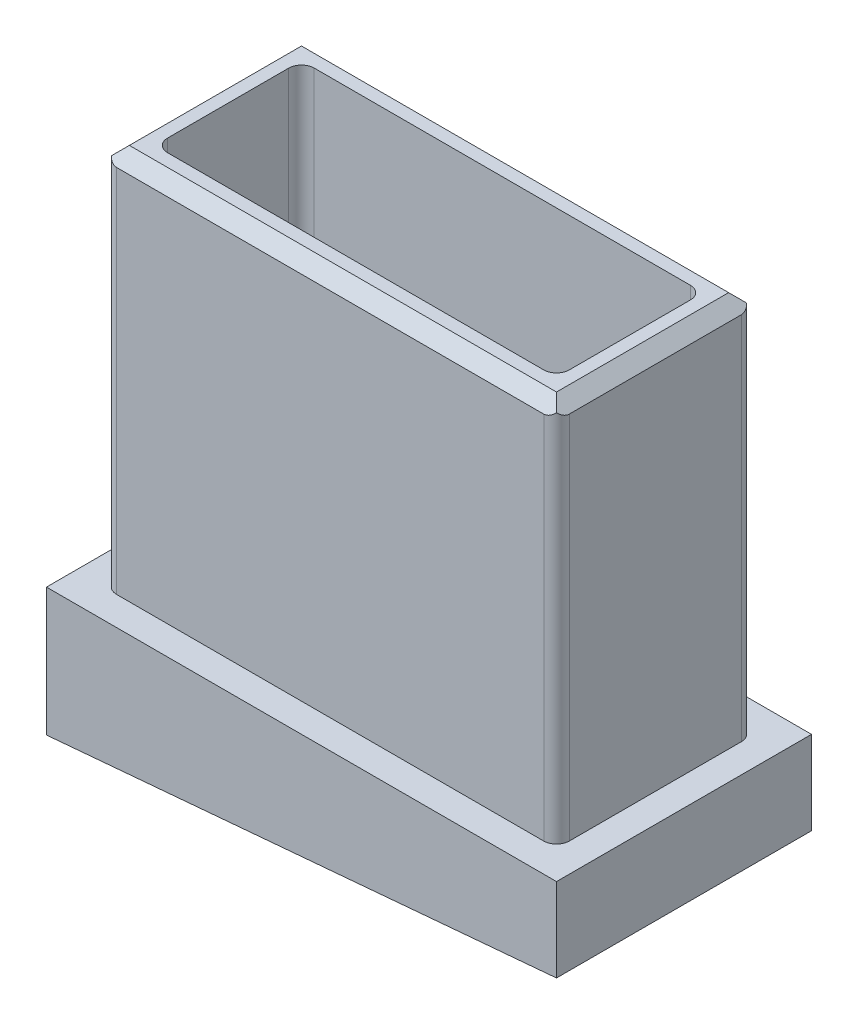
ISO-10303-21;
HEADER;
FILE_DESCRIPTION(('STEP AP214'),'2;1');
FILE_NAME('part.step','',(''),(''),'','','');
FILE_SCHEMA(('AUTOMOTIVE_DESIGN { 1 0 10303 214 1 1 1 1 }'));
ENDSEC;
DATA;
#1=APPLICATION_CONTEXT('core data for automotive mechanical design processes');
#2=APPLICATION_PROTOCOL_DEFINITION('international standard','automotive_design',2000,#1);
#3=PRODUCT_CONTEXT('',#1,'mechanical');
#4=PRODUCT('Part','Part','',(#3));
#5=PRODUCT_RELATED_PRODUCT_CATEGORY('part','',(#4));
#6=PRODUCT_DEFINITION_FORMATION('','',#4);
#7=PRODUCT_DEFINITION_CONTEXT('part definition',#1,'design');
#8=PRODUCT_DEFINITION('design','',#6,#7);
#9=PRODUCT_DEFINITION_SHAPE('','',#8);
#10=(LENGTH_UNIT() NAMED_UNIT(*) SI_UNIT(.MILLI.,.METRE.));
#11=(NAMED_UNIT(*) PLANE_ANGLE_UNIT() SI_UNIT($,.RADIAN.));
#12=(NAMED_UNIT(*) SI_UNIT($,.STERADIAN.) SOLID_ANGLE_UNIT());
#13=UNCERTAINTY_MEASURE_WITH_UNIT(LENGTH_MEASURE(1.E-05),#10,'distance_accuracy_value','');
#14=(GEOMETRIC_REPRESENTATION_CONTEXT(3) GLOBAL_UNCERTAINTY_ASSIGNED_CONTEXT((#13)) GLOBAL_UNIT_ASSIGNED_CONTEXT((#10,
#11,#12)) REPRESENTATION_CONTEXT('',''));
#15=CARTESIAN_POINT('',(0.,0.,0.));
#16=DIRECTION('',(0.,0.,1.));
#17=DIRECTION('',(1.,0.,0.));
#18=AXIS2_PLACEMENT_3D('',#15,#16,#17);
#19=CARTESIAN_POINT('',(22.5425,19.05,9.8425));
#20=DIRECTION('',(-1.,0.,0.));
#21=DIRECTION('',(0.,-1.,0.));
#22=AXIS2_PLACEMENT_3D('',#19,#20,#21);
#23=PLANE('',#22);
#24=DIRECTION('',(0.,0.,1.));
#25=VECTOR('',#24,1.);
#26=CARTESIAN_POINT('',(22.5425,17.78,9.8425));
#27=LINE('',#26,#25);
#28=CARTESIAN_POINT('',(22.5425,17.78,-8.5725));
#29=VERTEX_POINT('',#28);
#30=CARTESIAN_POINT('',(22.5425,17.78,8.5725));
#31=VERTEX_POINT('',#30);
#32=EDGE_CURVE('E256',#29,#31,#27,.T.);
#33=ORIENTED_EDGE('',*,*,#32,.T.);
#34=DIRECTION('',(0.,1.,0.));
#35=VECTOR('',#34,1.);
#36=CARTESIAN_POINT('',(22.5425,-19.05,8.5725));
#37=LINE('',#36,#35);
#38=CARTESIAN_POINT('',(22.5425,-19.05,8.5725));
#39=VERTEX_POINT('',#38);
#40=EDGE_CURVE('E290',#31,#39,#37,.F.);
#41=ORIENTED_EDGE('',*,*,#40,.T.);
#42=DIRECTION('',(0.,0.,-1.));
#43=VECTOR('',#42,1.);
#44=CARTESIAN_POINT('',(22.5425,-19.05,9.8425));
#45=LINE('',#44,#43);
#46=CARTESIAN_POINT('',(22.5425,-19.05,-8.5725));
#47=VERTEX_POINT('',#46);
#48=EDGE_CURVE('E233',#39,#47,#45,.T.);
#49=ORIENTED_EDGE('',*,*,#48,.T.);
#50=DIRECTION('',(0.,1.,0.));
#51=VECTOR('',#50,1.);
#52=CARTESIAN_POINT('',(22.5425,19.05,-8.5725));
#53=LINE('',#52,#51);
#54=EDGE_CURVE('E287',#47,#29,#53,.T.);
#55=ORIENTED_EDGE('',*,*,#54,.T.);
#56=EDGE_LOOP('',(#33,#41,#49,#55));
#57=FACE_BOUND('',#56,.T.);
#58=ADVANCED_FACE('F33',(#57),#23,.F.);
#59=CARTESIAN_POINT('',(-22.5425,19.05,9.8425));
#60=DIRECTION('',(0.,-1.,0.));
#61=DIRECTION('',(0.,0.,-1.));
#62=AXIS2_PLACEMENT_3D('',#59,#60,#61);
#63=PLANE('',#62);
#64=DIRECTION('',(-1.,0.,0.));
#65=VECTOR('',#64,1.);
#66=CARTESIAN_POINT('',(-22.5425,19.05,-8.57249999999999));
#67=LINE('',#66,#65);
#68=CARTESIAN_POINT('',(21.2725,19.05,-8.57249999999999));
#69=VERTEX_POINT('',#68);
#70=CARTESIAN_POINT('',(-21.2725,19.05,-8.57249999999999));
#71=VERTEX_POINT('',#70);
#72=EDGE_CURVE('E248',#69,#71,#67,.T.);
#73=ORIENTED_EDGE('',*,*,#72,.T.);
#74=DIRECTION('',(0.,0.,1.));
#75=VECTOR('',#74,1.);
#76=CARTESIAN_POINT('',(-21.2725,19.05,9.8425));
#77=LINE('',#76,#75);
#78=CARTESIAN_POINT('',(-21.2725,19.05,8.57249999999999));
#79=VERTEX_POINT('',#78);
#80=EDGE_CURVE('E250',#71,#79,#77,.T.);
#81=ORIENTED_EDGE('',*,*,#80,.T.);
#82=DIRECTION('',(1.,0.,0.));
#83=VECTOR('',#82,1.);
#84=CARTESIAN_POINT('',(22.5425,19.05,8.57249999999999));
#85=LINE('',#84,#83);
#86=CARTESIAN_POINT('',(21.2725,19.05,8.57249999999999));
#87=VERTEX_POINT('',#86);
#88=EDGE_CURVE('E243',#79,#87,#85,.T.);
#89=ORIENTED_EDGE('',*,*,#88,.T.);
#90=DIRECTION('',(0.,0.,-1.));
#91=VECTOR('',#90,1.);
#92=CARTESIAN_POINT('',(21.2725,19.05,9.8425));
#93=LINE('',#92,#91);
#94=EDGE_CURVE('E246',#87,#69,#93,.T.);
#95=ORIENTED_EDGE('',*,*,#94,.T.);
#96=EDGE_LOOP('',(#73,#81,#89,#95));
#97=FACE_BOUND('',#96,.T.);
#98=DIRECTION('',(-1.,0.,0.));
#99=VECTOR('',#98,1.);
#100=CARTESIAN_POINT('',(-20.0025,19.05,-7.3025));
#101=LINE('',#100,#99);
#102=CARTESIAN_POINT('',(18.7325,19.05,-7.3025));
#103=VERTEX_POINT('',#102);
#104=CARTESIAN_POINT('',(-18.7325,19.05,-7.3025));
#105=VERTEX_POINT('',#104);
#106=EDGE_CURVE('E656',#103,#105,#101,.T.);
#107=ORIENTED_EDGE('',*,*,#106,.F.);
#108=CARTESIAN_POINT('',(18.7325,19.05,-6.0325));
#109=DIRECTION('',(0.,-1.,0.));
#110=DIRECTION('',(0.,0.,-1.));
#111=AXIS2_PLACEMENT_3D('',#108,#109,#110);
#112=CIRCLE('',#111,1.27);
#113=CARTESIAN_POINT('',(20.0025,19.05,-6.0325));
#114=VERTEX_POINT('',#113);
#115=EDGE_CURVE('E342',#103,#114,#112,.T.);
#116=ORIENTED_EDGE('',*,*,#115,.T.);
#117=DIRECTION('',(0.,0.,-1.));
#118=VECTOR('',#117,1.);
#119=CARTESIAN_POINT('',(20.0025,19.05,-7.3025));
#120=LINE('',#119,#118);
#121=CARTESIAN_POINT('',(20.0025,19.05,6.0325));
#122=VERTEX_POINT('',#121);
#123=EDGE_CURVE('E273',#122,#114,#120,.T.);
#124=ORIENTED_EDGE('',*,*,#123,.F.);
#125=CARTESIAN_POINT('',(18.7325,19.05,6.0325));
#126=DIRECTION('',(0.,-1.,0.));
#127=DIRECTION('',(0.,0.,-1.));
#128=AXIS2_PLACEMENT_3D('',#125,#126,#127);
#129=CIRCLE('',#128,1.27);
#130=CARTESIAN_POINT('',(18.7325,19.05,7.3025));
#131=VERTEX_POINT('',#130);
#132=EDGE_CURVE('E340',#122,#131,#129,.T.);
#133=ORIENTED_EDGE('',*,*,#132,.T.);
#134=DIRECTION('',(1.,0.,0.));
#135=VECTOR('',#134,1.);
#136=CARTESIAN_POINT('',(-20.0025,19.05,7.3025));
#137=LINE('',#136,#135);
#138=CARTESIAN_POINT('',(-18.7325,19.05,7.3025));
#139=VERTEX_POINT('',#138);
#140=EDGE_CURVE('E649',#139,#131,#137,.T.);
#141=ORIENTED_EDGE('',*,*,#140,.F.);
#142=CARTESIAN_POINT('',(-18.7325,19.05,6.0325));
#143=DIRECTION('',(0.,-1.,0.));
#144=DIRECTION('',(0.,0.,-1.));
#145=AXIS2_PLACEMENT_3D('',#142,#143,#144);
#146=CIRCLE('',#145,1.27);
#147=CARTESIAN_POINT('',(-20.0025,19.05,6.0325));
#148=VERTEX_POINT('',#147);
#149=EDGE_CURVE('E344',#139,#148,#146,.T.);
#150=ORIENTED_EDGE('',*,*,#149,.T.);
#151=DIRECTION('',(0.,0.,1.));
#152=VECTOR('',#151,1.);
#153=CARTESIAN_POINT('',(-20.0025,19.05,-7.3025));
#154=LINE('',#153,#152);
#155=CARTESIAN_POINT('',(-20.0025,19.05,-6.0325));
#156=VERTEX_POINT('',#155);
#157=EDGE_CURVE('E653',#156,#148,#154,.T.);
#158=ORIENTED_EDGE('',*,*,#157,.F.);
#159=CARTESIAN_POINT('',(-18.7325,19.05,-6.0325));
#160=DIRECTION('',(0.,-1.,0.));
#161=DIRECTION('',(0.,0.,-1.));
#162=AXIS2_PLACEMENT_3D('',#159,#160,#161);
#163=CIRCLE('',#162,1.27);
#164=EDGE_CURVE('E346',#156,#105,#163,.T.);
#165=ORIENTED_EDGE('',*,*,#164,.T.);
#166=EDGE_LOOP('',(#107,#116,#124,#133,#141,#150,#158,#165));
#167=FACE_BOUND('',#166,.T.);
#168=ADVANCED_FACE('F369',(#97,#167),#63,.F.);
#169=CARTESIAN_POINT('',(-22.5425,19.05,9.8425));
#170=DIRECTION('',(1.,0.,0.));
#171=DIRECTION('',(0.,1.,0.));
#172=AXIS2_PLACEMENT_3D('',#169,#170,#171);
#173=PLANE('',#172);
#174=DIRECTION('',(0.,0.,-1.));
#175=VECTOR('',#174,1.);
#176=CARTESIAN_POINT('',(-22.5425,17.78,9.8425));
#177=LINE('',#176,#175);
#178=CARTESIAN_POINT('',(-22.5425,17.78,8.5725));
#179=VERTEX_POINT('',#178);
#180=CARTESIAN_POINT('',(-22.5425,17.78,-8.5725));
#181=VERTEX_POINT('',#180);
#182=EDGE_CURVE('E240',#179,#181,#177,.T.);
#183=ORIENTED_EDGE('',*,*,#182,.T.);
#184=DIRECTION('',(0.,-1.,0.));
#185=VECTOR('',#184,1.);
#186=CARTESIAN_POINT('',(-22.5425,19.05,-8.5725));
#187=LINE('',#186,#185);
#188=CARTESIAN_POINT('',(-22.5425,-19.05,-8.5725));
#189=VERTEX_POINT('',#188);
#190=EDGE_CURVE('E330',#181,#189,#187,.T.);
#191=ORIENTED_EDGE('',*,*,#190,.T.);
#192=DIRECTION('',(0.,0.,-1.));
#193=VECTOR('',#192,1.);
#194=CARTESIAN_POINT('',(-22.5425,-19.05,9.8425));
#195=LINE('',#194,#193);
#196=CARTESIAN_POINT('',(-22.5425,-19.05,8.5725));
#197=VERTEX_POINT('',#196);
#198=EDGE_CURVE('E238',#197,#189,#195,.T.);
#199=ORIENTED_EDGE('',*,*,#198,.F.);
#200=DIRECTION('',(0.,-1.,0.));
#201=VECTOR('',#200,1.);
#202=CARTESIAN_POINT('',(-22.5425,17.78,8.5725));
#203=LINE('',#202,#201);
#204=EDGE_CURVE('E328',#197,#179,#203,.F.);
#205=ORIENTED_EDGE('',*,*,#204,.T.);
#206=EDGE_LOOP('',(#183,#191,#199,#205));
#207=FACE_BOUND('',#206,.T.);
#208=ADVANCED_FACE('F396',(#207),#173,.F.);
#209=CARTESIAN_POINT('',(0.,0.,9.8425));
#210=DIRECTION('',(0.,0.,1.));
#211=DIRECTION('',(1.,0.,0.));
#212=AXIS2_PLACEMENT_3D('',#209,#210,#211);
#213=PLANE('',#212);
#214=DIRECTION('',(1.,0.,0.));
#215=VECTOR('',#214,1.);
#216=CARTESIAN_POINT('',(-22.5425,-19.05,9.8425));
#217=LINE('',#216,#215);
#218=CARTESIAN_POINT('',(-21.2725,-19.05,9.8425));
#219=VERTEX_POINT('',#218);
#220=CARTESIAN_POINT('',(21.2725,-19.05,9.8425));
#221=VERTEX_POINT('',#220);
#222=EDGE_CURVE('E230',#219,#221,#217,.T.);
#223=ORIENTED_EDGE('',*,*,#222,.T.);
#224=DIRECTION('',(0.,1.,0.));
#225=VECTOR('',#224,1.);
#226=CARTESIAN_POINT('',(21.2725,17.78,9.8425));
#227=LINE('',#226,#225);
#228=CARTESIAN_POINT('',(21.2725,17.78,9.8425));
#229=VERTEX_POINT('',#228);
#230=EDGE_CURVE('E276',#221,#229,#227,.T.);
#231=ORIENTED_EDGE('',*,*,#230,.T.);
#232=DIRECTION('',(-1.,0.,0.));
#233=VECTOR('',#232,1.);
#234=CARTESIAN_POINT('',(-22.5425,17.78,9.8425));
#235=LINE('',#234,#233);
#236=CARTESIAN_POINT('',(-21.2725,17.78,9.8425));
#237=VERTEX_POINT('',#236);
#238=EDGE_CURVE('E259',#229,#237,#235,.T.);
#239=ORIENTED_EDGE('',*,*,#238,.T.);
#240=DIRECTION('',(0.,-1.,0.));
#241=VECTOR('',#240,1.);
#242=CARTESIAN_POINT('',(-21.2725,-19.05,9.8425));
#243=LINE('',#242,#241);
#244=EDGE_CURVE('E262',#237,#219,#243,.T.);
#245=ORIENTED_EDGE('',*,*,#244,.T.);
#246=EDGE_LOOP('',(#223,#231,#239,#245));
#247=FACE_BOUND('',#246,.T.);
#248=ADVANCED_FACE('F388',(#247),#213,.T.);
#249=CARTESIAN_POINT('',(0.,0.,-9.8425));
#250=DIRECTION('',(0.,0.,1.));
#251=DIRECTION('',(1.,0.,0.));
#252=AXIS2_PLACEMENT_3D('',#249,#250,#251);
#253=PLANE('',#252);
#254=DIRECTION('',(1.,0.,0.));
#255=VECTOR('',#254,1.);
#256=CARTESIAN_POINT('',(0.,17.78,-9.8425));
#257=LINE('',#256,#255);
#258=CARTESIAN_POINT('',(-21.2725,17.78,-9.8425));
#259=VERTEX_POINT('',#258);
#260=CARTESIAN_POINT('',(21.2725,17.78,-9.8425));
#261=VERTEX_POINT('',#260);
#262=EDGE_CURVE('E253',#259,#261,#257,.T.);
#263=ORIENTED_EDGE('',*,*,#262,.T.);
#264=DIRECTION('',(0.,1.,0.));
#265=VECTOR('',#264,1.);
#266=CARTESIAN_POINT('',(21.2725,0.,-9.8425));
#267=LINE('',#266,#265);
#268=CARTESIAN_POINT('',(21.2725,-19.05,-9.8425));
#269=VERTEX_POINT('',#268);
#270=EDGE_CURVE('E298',#261,#269,#267,.F.);
#271=ORIENTED_EDGE('',*,*,#270,.T.);
#272=DIRECTION('',(1.,0.,0.));
#273=VECTOR('',#272,1.);
#274=CARTESIAN_POINT('',(-22.5425,-19.05,-9.8425));
#275=LINE('',#274,#273);
#276=CARTESIAN_POINT('',(-21.2725,-19.05,-9.8425));
#277=VERTEX_POINT('',#276);
#278=EDGE_CURVE('E229',#277,#269,#275,.T.);
#279=ORIENTED_EDGE('',*,*,#278,.F.);
#280=DIRECTION('',(0.,-1.,0.));
#281=VECTOR('',#280,1.);
#282=CARTESIAN_POINT('',(-21.2725,0.,-9.8425));
#283=LINE('',#282,#281);
#284=EDGE_CURVE('E296',#277,#259,#283,.F.);
#285=ORIENTED_EDGE('',*,*,#284,.T.);
#286=EDGE_LOOP('',(#263,#271,#279,#285));
#287=FACE_BOUND('',#286,.T.);
#288=ADVANCED_FACE('F352',(#287),#253,.F.);
#289=CARTESIAN_POINT('',(25.4,-31.8135,-12.7));
#290=DIRECTION('',(-1.,0.,0.));
#291=DIRECTION('',(0.,0.,1.));
#292=AXIS2_PLACEMENT_3D('',#289,#290,#291);
#293=PLANE('',#292);
#294=DIRECTION('',(0.,1.,0.));
#295=VECTOR('',#294,1.);
#296=CARTESIAN_POINT('',(25.4,-31.8135,12.7));
#297=LINE('',#296,#295);
#298=CARTESIAN_POINT('',(25.4,-27.3690758928834,12.7));
#299=VERTEX_POINT('',#298);
#300=CARTESIAN_POINT('',(25.4,-19.05,12.7));
#301=VERTEX_POINT('',#300);
#302=EDGE_CURVE('E211',#299,#301,#297,.T.);
#303=ORIENTED_EDGE('',*,*,#302,.F.);
#304=DIRECTION('',(0.,0.,1.));
#305=VECTOR('',#304,1.);
#306=CARTESIAN_POINT('',(25.4,-27.3690758928834,-12.7));
#307=LINE('',#306,#305);
#308=CARTESIAN_POINT('',(25.4,-27.3690758928834,-12.7));
#309=VERTEX_POINT('',#308);
#310=EDGE_CURVE('E195',#309,#299,#307,.T.);
#311=ORIENTED_EDGE('',*,*,#310,.F.);
#312=DIRECTION('',(0.,1.,0.));
#313=VECTOR('',#312,1.);
#314=CARTESIAN_POINT('',(25.4,-31.8135,-12.7));
#315=LINE('',#314,#313);
#316=CARTESIAN_POINT('',(25.4,-19.05,-12.7));
#317=VERTEX_POINT('',#316);
#318=EDGE_CURVE('E209',#309,#317,#315,.T.);
#319=ORIENTED_EDGE('',*,*,#318,.T.);
#320=DIRECTION('',(0.,0.,1.));
#321=VECTOR('',#320,1.);
#322=CARTESIAN_POINT('',(25.4,-19.05,-12.7));
#323=LINE('',#322,#321);
#324=EDGE_CURVE('E212',#317,#301,#323,.T.);
#325=ORIENTED_EDGE('',*,*,#324,.T.);
#326=EDGE_LOOP('',(#303,#311,#319,#325));
#327=FACE_BOUND('',#326,.T.);
#328=ADVANCED_FACE('F207',(#327),#293,.F.);
#329=CARTESIAN_POINT('',(-25.4,-31.8135,12.7));
#330=DIRECTION('',(0.,0.,-1.));
#331=DIRECTION('',(-1.,0.,0.));
#332=AXIS2_PLACEMENT_3D('',#329,#330,#331);
#333=PLANE('',#332);
#334=DIRECTION('',(0.,1.,0.));
#335=VECTOR('',#334,1.);
#336=CARTESIAN_POINT('',(-25.4,-31.8135,12.7));
#337=LINE('',#336,#335);
#338=CARTESIAN_POINT('',(-25.4,-31.8135,12.7));
#339=VERTEX_POINT('',#338);
#340=CARTESIAN_POINT('',(-25.4,-19.05,12.7));
#341=VERTEX_POINT('',#340);
#342=EDGE_CURVE('E220',#339,#341,#337,.T.);
#343=ORIENTED_EDGE('',*,*,#342,.F.);
#344=DIRECTION('',(-0.996194698091746,-0.0871557427476516,0.));
#345=VECTOR('',#344,1.);
#346=CARTESIAN_POINT('',(25.4,-27.3690758928834,12.7));
#347=LINE('',#346,#345);
#348=EDGE_CURVE('E203',#299,#339,#347,.T.);
#349=ORIENTED_EDGE('',*,*,#348,.F.);
#350=ORIENTED_EDGE('',*,*,#302,.T.);
#351=DIRECTION('',(-1.,0.,0.));
#352=VECTOR('',#351,1.);
#353=CARTESIAN_POINT('',(-25.4,-19.05,12.7));
#354=LINE('',#353,#352);
#355=EDGE_CURVE('E641',#301,#341,#354,.T.);
#356=ORIENTED_EDGE('',*,*,#355,.T.);
#357=EDGE_LOOP('',(#343,#349,#350,#356));
#358=FACE_BOUND('',#357,.T.);
#359=ADVANCED_FACE('F583',(#358),#333,.F.);
#360=CARTESIAN_POINT('',(-25.4,-31.8135,-12.7));
#361=DIRECTION('',(1.,0.,0.));
#362=DIRECTION('',(0.,0.,-1.));
#363=AXIS2_PLACEMENT_3D('',#360,#361,#362);
#364=PLANE('',#363);
#365=DIRECTION('',(0.,0.,-1.));
#366=VECTOR('',#365,1.);
#367=CARTESIAN_POINT('',(-25.4,-19.05,-12.7));
#368=LINE('',#367,#366);
#369=CARTESIAN_POINT('',(-25.4,-19.05,-12.7));
#370=VERTEX_POINT('',#369);
#371=EDGE_CURVE('E643',#341,#370,#368,.T.);
#372=ORIENTED_EDGE('',*,*,#371,.T.);
#373=DIRECTION('',(0.,1.,0.));
#374=VECTOR('',#373,1.);
#375=CARTESIAN_POINT('',(-25.4,-31.8135,-12.7));
#376=LINE('',#375,#374);
#377=CARTESIAN_POINT('',(-25.4,-31.8135,-12.7));
#378=VERTEX_POINT('',#377);
#379=EDGE_CURVE('E218',#378,#370,#376,.T.);
#380=ORIENTED_EDGE('',*,*,#379,.F.);
#381=DIRECTION('',(0.,0.,-1.));
#382=VECTOR('',#381,1.);
#383=CARTESIAN_POINT('',(-25.4,-31.8135,-12.7));
#384=LINE('',#383,#382);
#385=EDGE_CURVE('E198',#339,#378,#384,.T.);
#386=ORIENTED_EDGE('',*,*,#385,.F.);
#387=ORIENTED_EDGE('',*,*,#342,.T.);
#388=EDGE_LOOP('',(#372,#380,#386,#387));
#389=FACE_BOUND('',#388,.T.);
#390=ADVANCED_FACE('F575',(#389),#364,.F.);
#391=CARTESIAN_POINT('',(-25.4,-31.8135,-12.7));
#392=DIRECTION('',(0.,0.,1.));
#393=DIRECTION('',(1.,0.,0.));
#394=AXIS2_PLACEMENT_3D('',#391,#392,#393);
#395=PLANE('',#394);
#396=ORIENTED_EDGE('',*,*,#318,.F.);
#397=DIRECTION('',(-0.996194698091746,-0.0871557427476516,0.));
#398=VECTOR('',#397,1.);
#399=CARTESIAN_POINT('',(25.4,-27.3690758928834,-12.7));
#400=LINE('',#399,#398);
#401=EDGE_CURVE('E192',#309,#378,#400,.T.);
#402=ORIENTED_EDGE('',*,*,#401,.T.);
#403=ORIENTED_EDGE('',*,*,#379,.T.);
#404=DIRECTION('',(1.,0.,0.));
#405=VECTOR('',#404,1.);
#406=CARTESIAN_POINT('',(-25.4,-19.05,-12.7));
#407=LINE('',#406,#405);
#408=EDGE_CURVE('E216',#370,#317,#407,.T.);
#409=ORIENTED_EDGE('',*,*,#408,.T.);
#410=EDGE_LOOP('',(#396,#402,#403,#409));
#411=FACE_BOUND('',#410,.T.);
#412=ADVANCED_FACE('F214',(#411),#395,.F.);
#413=CARTESIAN_POINT('',(0.,-19.05,0.));
#414=DIRECTION('',(0.,1.,0.));
#415=DIRECTION('',(0.,0.,1.));
#416=AXIS2_PLACEMENT_3D('',#413,#414,#415);
#417=PLANE('',#416);
#418=ORIENTED_EDGE('',*,*,#222,.F.);
#419=CARTESIAN_POINT('',(-21.2725,-19.05,8.5725));
#420=DIRECTION('',(0.,1.,0.));
#421=DIRECTION('',(0.,0.,1.));
#422=AXIS2_PLACEMENT_3D('',#419,#420,#421);
#423=CIRCLE('',#422,1.27);
#424=EDGE_CURVE('E11',#219,#197,#423,.F.);
#425=ORIENTED_EDGE('',*,*,#424,.T.);
#426=ORIENTED_EDGE('',*,*,#198,.T.);
#427=CARTESIAN_POINT('',(-21.2725,-19.05,-8.5725));
#428=DIRECTION('',(0.,1.,0.));
#429=DIRECTION('',(0.,0.,1.));
#430=AXIS2_PLACEMENT_3D('',#427,#428,#429);
#431=CIRCLE('',#430,1.27);
#432=EDGE_CURVE('E41',#189,#277,#431,.F.);
#433=ORIENTED_EDGE('',*,*,#432,.T.);
#434=ORIENTED_EDGE('',*,*,#278,.T.);
#435=CARTESIAN_POINT('',(21.2725,-19.05,-8.5725));
#436=DIRECTION('',(0.,1.,0.));
#437=DIRECTION('',(0.,0.,1.));
#438=AXIS2_PLACEMENT_3D('',#435,#436,#437);
#439=CIRCLE('',#438,1.27);
#440=EDGE_CURVE('E338',#269,#47,#439,.F.);
#441=ORIENTED_EDGE('',*,*,#440,.T.);
#442=ORIENTED_EDGE('',*,*,#48,.F.);
#443=CARTESIAN_POINT('',(21.2725,-19.05,8.5725));
#444=DIRECTION('',(0.,1.,0.));
#445=DIRECTION('',(0.,0.,1.));
#446=AXIS2_PLACEMENT_3D('',#443,#444,#445);
#447=CIRCLE('',#446,1.27);
#448=EDGE_CURVE('E336',#39,#221,#447,.F.);
#449=ORIENTED_EDGE('',*,*,#448,.T.);
#450=EDGE_LOOP('',(#418,#425,#426,#433,#434,#441,#442,#449));
#451=FACE_BOUND('',#450,.T.);
#452=ORIENTED_EDGE('',*,*,#324,.F.);
#453=ORIENTED_EDGE('',*,*,#408,.F.);
#454=ORIENTED_EDGE('',*,*,#371,.F.);
#455=ORIENTED_EDGE('',*,*,#355,.F.);
#456=EDGE_LOOP('',(#452,#453,#454,#455));
#457=FACE_BOUND('',#456,.T.);
#458=ADVANCED_FACE('F348',(#451,#457),#417,.T.);
#459=CARTESIAN_POINT('',(25.4,-27.3690758928834,-12.7));
#460=DIRECTION('',(-0.0871557427476516,0.996194698091746,0.));
#461=DIRECTION('',(-0.996194698091746,-0.0871557427476516,0.));
#462=AXIS2_PLACEMENT_3D('',#459,#460,#461);
#463=PLANE('',#462);
#464=ORIENTED_EDGE('',*,*,#348,.T.);
#465=ORIENTED_EDGE('',*,*,#385,.T.);
#466=ORIENTED_EDGE('',*,*,#401,.F.);
#467=ORIENTED_EDGE('',*,*,#310,.T.);
#468=EDGE_LOOP('',(#464,#465,#466,#467));
#469=FACE_BOUND('',#468,.T.);
#470=ADVANCED_FACE('F194',(#469),#463,.F.);
#471=CARTESIAN_POINT('',(20.0025,-19.05,-7.3025));
#472=DIRECTION('',(1.,0.,0.));
#473=DIRECTION('',(0.,0.,-1.));
#474=AXIS2_PLACEMENT_3D('',#471,#472,#473);
#475=PLANE('',#474);
#476=DIRECTION('',(0.,0.,-1.));
#477=VECTOR('',#476,1.);
#478=CARTESIAN_POINT('',(20.0025,-19.05,-7.3025));
#479=LINE('',#478,#477);
#480=CARTESIAN_POINT('',(20.0025,-19.05,6.0325));
#481=VERTEX_POINT('',#480);
#482=CARTESIAN_POINT('',(20.0025,-19.05,-6.0325));
#483=VERTEX_POINT('',#482);
#484=EDGE_CURVE('E652',#481,#483,#479,.T.);
#485=ORIENTED_EDGE('',*,*,#484,.F.);
#486=DIRECTION('',(0.,1.,0.));
#487=VECTOR('',#486,1.);
#488=CARTESIAN_POINT('',(20.0025,19.05,6.0325));
#489=LINE('',#488,#487);
#490=EDGE_CURVE('E302',#481,#122,#489,.T.);
#491=ORIENTED_EDGE('',*,*,#490,.T.);
#492=ORIENTED_EDGE('',*,*,#123,.T.);
#493=DIRECTION('',(0.,1.,0.));
#494=VECTOR('',#493,1.);
#495=CARTESIAN_POINT('',(20.0025,-19.05,-6.0325));
#496=LINE('',#495,#494);
#497=EDGE_CURVE('E300',#114,#483,#496,.F.);
#498=ORIENTED_EDGE('',*,*,#497,.T.);
#499=EDGE_LOOP('',(#485,#491,#492,#498));
#500=FACE_BOUND('',#499,.T.);
#501=ADVANCED_FACE('F545',(#500),#475,.F.);
#502=CARTESIAN_POINT('',(-20.0025,-19.05,7.3025));
#503=DIRECTION('',(0.,0.,1.));
#504=DIRECTION('',(1.,0.,0.));
#505=AXIS2_PLACEMENT_3D('',#502,#503,#504);
#506=PLANE('',#505);
#507=ORIENTED_EDGE('',*,*,#140,.T.);
#508=DIRECTION('',(0.,1.,0.));
#509=VECTOR('',#508,1.);
#510=CARTESIAN_POINT('',(18.7325,-19.05,7.3025));
#511=LINE('',#510,#509);
#512=CARTESIAN_POINT('',(18.7325,-19.05,7.3025));
#513=VERTEX_POINT('',#512);
#514=EDGE_CURVE('E308',#131,#513,#511,.F.);
#515=ORIENTED_EDGE('',*,*,#514,.T.);
#516=DIRECTION('',(1.,0.,0.));
#517=VECTOR('',#516,1.);
#518=CARTESIAN_POINT('',(-20.0025,-19.05,7.3025));
#519=LINE('',#518,#517);
#520=CARTESIAN_POINT('',(-18.7325,-19.05,7.3025));
#521=VERTEX_POINT('',#520);
#522=EDGE_CURVE('E647',#521,#513,#519,.T.);
#523=ORIENTED_EDGE('',*,*,#522,.F.);
#524=DIRECTION('',(0.,1.,0.));
#525=VECTOR('',#524,1.);
#526=CARTESIAN_POINT('',(-18.7325,19.05,7.3025));
#527=LINE('',#526,#525);
#528=EDGE_CURVE('E305',#521,#139,#527,.T.);
#529=ORIENTED_EDGE('',*,*,#528,.T.);
#530=EDGE_LOOP('',(#507,#515,#523,#529));
#531=FACE_BOUND('',#530,.T.);
#532=ADVANCED_FACE('F536',(#531),#506,.F.);
#533=CARTESIAN_POINT('',(-20.0025,-19.05,-7.3025));
#534=DIRECTION('',(-1.,0.,0.));
#535=DIRECTION('',(0.,0.,1.));
#536=AXIS2_PLACEMENT_3D('',#533,#534,#535);
#537=PLANE('',#536);
#538=ORIENTED_EDGE('',*,*,#157,.T.);
#539=DIRECTION('',(0.,1.,0.));
#540=VECTOR('',#539,1.);
#541=CARTESIAN_POINT('',(-20.0025,-19.05,6.0325));
#542=LINE('',#541,#540);
#543=CARTESIAN_POINT('',(-20.0025,-19.05,6.0325));
#544=VERTEX_POINT('',#543);
#545=EDGE_CURVE('E326',#148,#544,#542,.F.);
#546=ORIENTED_EDGE('',*,*,#545,.T.);
#547=DIRECTION('',(0.,0.,1.));
#548=VECTOR('',#547,1.);
#549=CARTESIAN_POINT('',(-20.0025,-19.05,-7.3025));
#550=LINE('',#549,#548);
#551=CARTESIAN_POINT('',(-20.0025,-19.05,-6.0325));
#552=VERTEX_POINT('',#551);
#553=EDGE_CURVE('E663',#552,#544,#550,.T.);
#554=ORIENTED_EDGE('',*,*,#553,.F.);
#555=DIRECTION('',(0.,1.,0.));
#556=VECTOR('',#555,1.);
#557=CARTESIAN_POINT('',(-20.0025,19.05,-6.0325));
#558=LINE('',#557,#556);
#559=EDGE_CURVE('E323',#552,#156,#558,.T.);
#560=ORIENTED_EDGE('',*,*,#559,.T.);
#561=EDGE_LOOP('',(#538,#546,#554,#560));
#562=FACE_BOUND('',#561,.T.);
#563=ADVANCED_FACE('F527',(#562),#537,.F.);
#564=CARTESIAN_POINT('',(-20.0025,-19.05,-7.3025));
#565=DIRECTION('',(0.,0.,-1.));
#566=DIRECTION('',(-1.,0.,0.));
#567=AXIS2_PLACEMENT_3D('',#564,#565,#566);
#568=PLANE('',#567);
#569=DIRECTION('',(-1.,0.,0.));
#570=VECTOR('',#569,1.);
#571=CARTESIAN_POINT('',(-20.0025,-19.05,-7.3025));
#572=LINE('',#571,#570);
#573=CARTESIAN_POINT('',(18.7325,-19.05,-7.3025));
#574=VERTEX_POINT('',#573);
#575=CARTESIAN_POINT('',(-18.7325,-19.05,-7.3025));
#576=VERTEX_POINT('',#575);
#577=EDGE_CURVE('E666',#574,#576,#572,.T.);
#578=ORIENTED_EDGE('',*,*,#577,.F.);
#579=DIRECTION('',(0.,1.,0.));
#580=VECTOR('',#579,1.);
#581=CARTESIAN_POINT('',(18.7325,19.05,-7.3025));
#582=LINE('',#581,#580);
#583=EDGE_CURVE('E320',#574,#103,#582,.T.);
#584=ORIENTED_EDGE('',*,*,#583,.T.);
#585=ORIENTED_EDGE('',*,*,#106,.T.);
#586=DIRECTION('',(0.,1.,0.));
#587=VECTOR('',#586,1.);
#588=CARTESIAN_POINT('',(-18.7325,-19.05,-7.3025));
#589=LINE('',#588,#587);
#590=EDGE_CURVE('E318',#105,#576,#589,.F.);
#591=ORIENTED_EDGE('',*,*,#590,.T.);
#592=EDGE_LOOP('',(#578,#584,#585,#591));
#593=FACE_BOUND('',#592,.T.);
#594=ADVANCED_FACE('F409',(#593),#568,.F.);
#595=CARTESIAN_POINT('',(0.,-19.05,0.));
#596=DIRECTION('',(0.,1.,0.));
#597=DIRECTION('',(0.,0.,1.));
#598=AXIS2_PLACEMENT_3D('',#595,#596,#597);
#599=PLANE('',#598);
#600=ORIENTED_EDGE('',*,*,#522,.T.);
#601=CARTESIAN_POINT('',(18.7325,-19.05,6.0325));
#602=DIRECTION('',(0.,1.,0.));
#603=DIRECTION('',(0.,0.,1.));
#604=AXIS2_PLACEMENT_3D('',#601,#602,#603);
#605=CIRCLE('',#604,1.27);
#606=EDGE_CURVE('E316',#513,#481,#605,.T.);
#607=ORIENTED_EDGE('',*,*,#606,.T.);
#608=ORIENTED_EDGE('',*,*,#484,.T.);
#609=CARTESIAN_POINT('',(18.7325,-19.05,-6.0325));
#610=DIRECTION('',(0.,1.,0.));
#611=DIRECTION('',(0.,0.,1.));
#612=AXIS2_PLACEMENT_3D('',#609,#610,#611);
#613=CIRCLE('',#612,1.27);
#614=EDGE_CURVE('E314',#483,#574,#613,.T.);
#615=ORIENTED_EDGE('',*,*,#614,.T.);
#616=ORIENTED_EDGE('',*,*,#577,.T.);
#617=CARTESIAN_POINT('',(-18.7325,-19.05,-6.0325));
#618=DIRECTION('',(0.,1.,0.));
#619=DIRECTION('',(0.,0.,1.));
#620=AXIS2_PLACEMENT_3D('',#617,#618,#619);
#621=CIRCLE('',#620,1.27);
#622=EDGE_CURVE('E310',#576,#552,#621,.T.);
#623=ORIENTED_EDGE('',*,*,#622,.T.);
#624=ORIENTED_EDGE('',*,*,#553,.T.);
#625=CARTESIAN_POINT('',(-18.7325,-19.05,6.0325));
#626=DIRECTION('',(0.,1.,0.));
#627=DIRECTION('',(0.,0.,1.));
#628=AXIS2_PLACEMENT_3D('',#625,#626,#627);
#629=CIRCLE('',#628,1.27);
#630=EDGE_CURVE('E312',#544,#521,#629,.T.);
#631=ORIENTED_EDGE('',*,*,#630,.T.);
#632=EDGE_LOOP('',(#600,#607,#608,#615,#616,#623,#624,#631));
#633=FACE_BOUND('',#632,.T.);
#634=ADVANCED_FACE('F402',(#633),#599,.T.);
#635=CARTESIAN_POINT('',(21.2725,19.05,9.8425));
#636=DIRECTION('',(-0.707106781186549,-0.707106781186547,0.));
#637=DIRECTION('',(0.,0.,-1.));
#638=AXIS2_PLACEMENT_3D('',#635,#636,#637);
#639=PLANE('',#638);
#640=DIRECTION('',(0.577350269189625,-0.577350269189626,0.577350269189626));
#641=VECTOR('',#640,1.);
#642=CARTESIAN_POINT('',(15.0283333333334,25.2941666666666,2.32833333333334));
#643=LINE('',#642,#641);
#644=CARTESIAN_POINT('',(22.1705256121069,18.1519743878931,9.47052561210692));
#645=VERTEX_POINT('',#644);
#646=EDGE_CURVE('E271',#645,#87,#643,.F.);
#647=ORIENTED_EDGE('',*,*,#646,.F.);
#648=CARTESIAN_POINT('',(21.2725,19.05,8.5725));
#649=DIRECTION('',(-0.707106781186549,-0.707106781186547,0.));
#650=DIRECTION('',(0.707106781186547,-0.707106781186549,0.));
#651=AXIS2_PLACEMENT_3D('',#648,#649,#650);
#652=ELLIPSE('',#651,1.79605122421383,1.27);
#653=EDGE_CURVE('E285',#645,#31,#652,.F.);
#654=ORIENTED_EDGE('',*,*,#653,.T.);
#655=ORIENTED_EDGE('',*,*,#32,.F.);
#656=CARTESIAN_POINT('',(21.2725,19.05,-8.5725));
#657=DIRECTION('',(-0.707106781186549,-0.707106781186547,0.));
#658=DIRECTION('',(-0.707106781186547,0.707106781186549,0.));
#659=AXIS2_PLACEMENT_3D('',#656,#657,#658);
#660=ELLIPSE('',#659,1.79605122421383,1.27);
#661=CARTESIAN_POINT('',(22.1705256121069,18.1519743878931,-9.47052561210692));
#662=VERTEX_POINT('',#661);
#663=EDGE_CURVE('E283',#29,#662,#660,.F.);
#664=ORIENTED_EDGE('',*,*,#663,.T.);
#665=DIRECTION('',(-0.577350269189625,0.577350269189626,0.577350269189626));
#666=VECTOR('',#665,1.);
#667=CARTESIAN_POINT('',(15.1341666666667,25.1883333333333,-2.43416666666665));
#668=LINE('',#667,#666);
#669=EDGE_CURVE('E268',#69,#662,#668,.F.);
#670=ORIENTED_EDGE('',*,*,#669,.F.);
#671=ORIENTED_EDGE('',*,*,#94,.F.);
#672=EDGE_LOOP('',(#647,#654,#655,#664,#670,#671));
#673=FACE_BOUND('',#672,.T.);
#674=ADVANCED_FACE('F400',(#673),#639,.F.);
#675=CARTESIAN_POINT('',(0.,17.78,9.8425));
#676=DIRECTION('',(0.,0.707106781186547,0.707106781186547));
#677=DIRECTION('',(1.,0.,0.));
#678=AXIS2_PLACEMENT_3D('',#675,#676,#677);
#679=PLANE('',#678);
#680=ORIENTED_EDGE('',*,*,#238,.F.);
#681=CARTESIAN_POINT('',(21.2725,19.05,8.5725));
#682=DIRECTION('',(0.,0.707106781186547,0.707106781186547));
#683=DIRECTION('',(0.,-0.707106781186548,0.707106781186548));
#684=AXIS2_PLACEMENT_3D('',#681,#682,#683);
#685=ELLIPSE('',#684,1.79605122421383,1.27);
#686=EDGE_CURVE('E281',#229,#645,#685,.T.);
#687=ORIENTED_EDGE('',*,*,#686,.T.);
#688=ORIENTED_EDGE('',*,*,#646,.T.);
#689=ORIENTED_EDGE('',*,*,#88,.F.);
#690=DIRECTION('',(0.577350269189626,0.577350269189626,-0.577350269189626));
#691=VECTOR('',#690,1.);
#692=CARTESIAN_POINT('',(-15.0283333333333,25.2941666666667,2.32833333333333));
#693=LINE('',#692,#691);
#694=CARTESIAN_POINT('',(-22.1705256121069,18.1519743878931,9.47052561210691));
#695=VERTEX_POINT('',#694);
#696=EDGE_CURVE('E266',#695,#79,#693,.T.);
#697=ORIENTED_EDGE('',*,*,#696,.F.);
#698=CARTESIAN_POINT('',(-21.2725,19.05,8.5725));
#699=DIRECTION('',(0.,0.707106781186547,0.707106781186547));
#700=DIRECTION('',(0.,0.707106781186548,-0.707106781186548));
#701=AXIS2_PLACEMENT_3D('',#698,#699,#700);
#702=ELLIPSE('',#701,1.79605122421383,1.27);
#703=EDGE_CURVE('E279',#695,#237,#702,.T.);
#704=ORIENTED_EDGE('',*,*,#703,.T.);
#705=EDGE_LOOP('',(#680,#687,#688,#689,#697,#704));
#706=FACE_BOUND('',#705,.T.);
#707=ADVANCED_FACE('F398',(#706),#679,.T.);
#708=CARTESIAN_POINT('',(-22.5425,19.05,-8.57249999999999));
#709=DIRECTION('',(0.,-0.707106781186547,0.707106781186547));
#710=DIRECTION('',(-1.,0.,0.));
#711=AXIS2_PLACEMENT_3D('',#708,#709,#710);
#712=PLANE('',#711);
#713=ORIENTED_EDGE('',*,*,#669,.T.);
#714=CARTESIAN_POINT('',(21.2725,19.05,-8.5725));
#715=DIRECTION('',(0.,-0.707106781186547,0.707106781186547));
#716=DIRECTION('',(0.,0.707106781186548,0.707106781186548));
#717=AXIS2_PLACEMENT_3D('',#714,#715,#716);
#718=ELLIPSE('',#717,1.79605122421383,1.27);
#719=EDGE_CURVE('E294',#662,#261,#718,.F.);
#720=ORIENTED_EDGE('',*,*,#719,.T.);
#721=ORIENTED_EDGE('',*,*,#262,.F.);
#722=CARTESIAN_POINT('',(-21.2725,19.05,-8.5725));
#723=DIRECTION('',(0.,-0.707106781186547,0.707106781186547));
#724=DIRECTION('',(0.,-0.707106781186548,-0.707106781186548));
#725=AXIS2_PLACEMENT_3D('',#722,#723,#724);
#726=ELLIPSE('',#725,1.79605122421383,1.27);
#727=CARTESIAN_POINT('',(-22.1705256121069,18.1519743878931,-9.47052561210692));
#728=VERTEX_POINT('',#727);
#729=EDGE_CURVE('E292',#259,#728,#726,.F.);
#730=ORIENTED_EDGE('',*,*,#729,.T.);
#731=DIRECTION('',(0.577350269189626,0.577350269189626,0.577350269189626));
#732=VECTOR('',#731,1.);
#733=CARTESIAN_POINT('',(-21.6958333333333,18.6266666666667,-8.99583333333333));
#734=LINE('',#733,#732);
#735=EDGE_CURVE('E263',#71,#728,#734,.F.);
#736=ORIENTED_EDGE('',*,*,#735,.F.);
#737=ORIENTED_EDGE('',*,*,#72,.F.);
#738=EDGE_LOOP('',(#713,#720,#721,#730,#736,#737));
#739=FACE_BOUND('',#738,.T.);
#740=ADVANCED_FACE('F360',(#739),#712,.F.);
#741=CARTESIAN_POINT('',(-22.5425,17.78,9.8425));
#742=DIRECTION('',(0.707106781186547,-0.707106781186547,0.));
#743=DIRECTION('',(0.,0.,-1.));
#744=AXIS2_PLACEMENT_3D('',#741,#742,#743);
#745=PLANE('',#744);
#746=ORIENTED_EDGE('',*,*,#735,.T.);
#747=CARTESIAN_POINT('',(-21.2725,19.05,-8.5725));
#748=DIRECTION('',(0.707106781186547,-0.707106781186547,0.));
#749=DIRECTION('',(-0.707106781186548,-0.707106781186548,0.));
#750=AXIS2_PLACEMENT_3D('',#747,#748,#749);
#751=ELLIPSE('',#750,1.79605122421383,1.27);
#752=EDGE_CURVE('E334',#728,#181,#751,.F.);
#753=ORIENTED_EDGE('',*,*,#752,.T.);
#754=ORIENTED_EDGE('',*,*,#182,.F.);
#755=CARTESIAN_POINT('',(-21.2725,19.05,8.5725));
#756=DIRECTION('',(0.707106781186547,-0.707106781186547,0.));
#757=DIRECTION('',(0.707106781186548,0.707106781186548,0.));
#758=AXIS2_PLACEMENT_3D('',#755,#756,#757);
#759=ELLIPSE('',#758,1.79605122421383,1.27);
#760=EDGE_CURVE('E332',#179,#695,#759,.F.);
#761=ORIENTED_EDGE('',*,*,#760,.T.);
#762=ORIENTED_EDGE('',*,*,#696,.T.);
#763=ORIENTED_EDGE('',*,*,#80,.F.);
#764=EDGE_LOOP('',(#746,#753,#754,#761,#762,#763));
#765=FACE_BOUND('',#764,.T.);
#766=ADVANCED_FACE('F364',(#765),#745,.F.);
#767=CARTESIAN_POINT('',(21.2725,0.,8.5725));
#768=DIRECTION('',(0.,-1.,0.));
#769=DIRECTION('',(1.,0.,0.));
#770=AXIS2_PLACEMENT_3D('',#767,#768,#769);
#771=CYLINDRICAL_SURFACE('',#770,1.27);
#772=ORIENTED_EDGE('',*,*,#448,.F.);
#773=ORIENTED_EDGE('',*,*,#40,.F.);
#774=ORIENTED_EDGE('',*,*,#653,.F.);
#775=ORIENTED_EDGE('',*,*,#686,.F.);
#776=ORIENTED_EDGE('',*,*,#230,.F.);
#777=EDGE_LOOP('',(#772,#773,#774,#775,#776));
#778=FACE_BOUND('',#777,.T.);
#779=ADVANCED_FACE('F385',(#778),#771,.T.);
#780=CARTESIAN_POINT('',(21.2725,19.05,-8.5725));
#781=DIRECTION('',(0.,1.,0.));
#782=DIRECTION('',(-1.,0.,0.));
#783=AXIS2_PLACEMENT_3D('',#780,#781,#782);
#784=CYLINDRICAL_SURFACE('',#783,1.27);
#785=ORIENTED_EDGE('',*,*,#440,.F.);
#786=ORIENTED_EDGE('',*,*,#270,.F.);
#787=ORIENTED_EDGE('',*,*,#719,.F.);
#788=ORIENTED_EDGE('',*,*,#663,.F.);
#789=ORIENTED_EDGE('',*,*,#54,.F.);
#790=EDGE_LOOP('',(#785,#786,#787,#788,#789));
#791=FACE_BOUND('',#790,.T.);
#792=ADVANCED_FACE('F376',(#791),#784,.T.);
#793=CARTESIAN_POINT('',(18.7325,-19.05,6.0325));
#794=DIRECTION('',(0.,-1.,0.));
#795=DIRECTION('',(0.,0.,-1.));
#796=AXIS2_PLACEMENT_3D('',#793,#794,#795);
#797=CYLINDRICAL_SURFACE('',#796,1.27);
#798=ORIENTED_EDGE('',*,*,#606,.F.);
#799=ORIENTED_EDGE('',*,*,#514,.F.);
#800=ORIENTED_EDGE('',*,*,#132,.F.);
#801=ORIENTED_EDGE('',*,*,#490,.F.);
#802=EDGE_LOOP('',(#798,#799,#800,#801));
#803=FACE_BOUND('',#802,.T.);
#804=ADVANCED_FACE('F444',(#803),#797,.F.);
#805=CARTESIAN_POINT('',(18.7325,-19.05,-6.0325));
#806=DIRECTION('',(0.,-1.,0.));
#807=DIRECTION('',(0.,0.,-1.));
#808=AXIS2_PLACEMENT_3D('',#805,#806,#807);
#809=CYLINDRICAL_SURFACE('',#808,1.27);
#810=ORIENTED_EDGE('',*,*,#614,.F.);
#811=ORIENTED_EDGE('',*,*,#497,.F.);
#812=ORIENTED_EDGE('',*,*,#115,.F.);
#813=ORIENTED_EDGE('',*,*,#583,.F.);
#814=EDGE_LOOP('',(#810,#811,#812,#813));
#815=FACE_BOUND('',#814,.T.);
#816=ADVANCED_FACE('F451',(#815),#809,.F.);
#817=CARTESIAN_POINT('',(-18.7325,-19.05,6.0325));
#818=DIRECTION('',(0.,-1.,0.));
#819=DIRECTION('',(0.,0.,-1.));
#820=AXIS2_PLACEMENT_3D('',#817,#818,#819);
#821=CYLINDRICAL_SURFACE('',#820,1.27);
#822=ORIENTED_EDGE('',*,*,#630,.F.);
#823=ORIENTED_EDGE('',*,*,#545,.F.);
#824=ORIENTED_EDGE('',*,*,#149,.F.);
#825=ORIENTED_EDGE('',*,*,#528,.F.);
#826=EDGE_LOOP('',(#822,#823,#824,#825));
#827=FACE_BOUND('',#826,.T.);
#828=ADVANCED_FACE('F459',(#827),#821,.F.);
#829=CARTESIAN_POINT('',(-18.7325,-19.05,-6.0325));
#830=DIRECTION('',(0.,-1.,0.));
#831=DIRECTION('',(0.,0.,-1.));
#832=AXIS2_PLACEMENT_3D('',#829,#830,#831);
#833=CYLINDRICAL_SURFACE('',#832,1.27);
#834=ORIENTED_EDGE('',*,*,#622,.F.);
#835=ORIENTED_EDGE('',*,*,#590,.F.);
#836=ORIENTED_EDGE('',*,*,#164,.F.);
#837=ORIENTED_EDGE('',*,*,#559,.F.);
#838=EDGE_LOOP('',(#834,#835,#836,#837));
#839=FACE_BOUND('',#838,.T.);
#840=ADVANCED_FACE('F467',(#839),#833,.F.);
#841=CARTESIAN_POINT('',(-21.2725,19.05,-8.5725));
#842=DIRECTION('',(0.,-1.,0.));
#843=DIRECTION('',(1.,0.,0.));
#844=AXIS2_PLACEMENT_3D('',#841,#842,#843);
#845=CYLINDRICAL_SURFACE('',#844,1.27);
#846=ORIENTED_EDGE('',*,*,#729,.F.);
#847=ORIENTED_EDGE('',*,*,#284,.F.);
#848=ORIENTED_EDGE('',*,*,#432,.F.);
#849=ORIENTED_EDGE('',*,*,#190,.F.);
#850=ORIENTED_EDGE('',*,*,#752,.F.);
#851=EDGE_LOOP('',(#846,#847,#848,#849,#850));
#852=FACE_BOUND('',#851,.T.);
#853=ADVANCED_FACE('F356',(#852),#845,.T.);
#854=CARTESIAN_POINT('',(-21.2725,0.,8.5725));
#855=DIRECTION('',(0.,1.,0.));
#856=DIRECTION('',(-1.,0.,0.));
#857=AXIS2_PLACEMENT_3D('',#854,#855,#856);
#858=CYLINDRICAL_SURFACE('',#857,1.27);
#859=ORIENTED_EDGE('',*,*,#760,.F.);
#860=ORIENTED_EDGE('',*,*,#204,.F.);
#861=ORIENTED_EDGE('',*,*,#424,.F.);
#862=ORIENTED_EDGE('',*,*,#244,.F.);
#863=ORIENTED_EDGE('',*,*,#703,.F.);
#864=EDGE_LOOP('',(#859,#860,#861,#862,#863));
#865=FACE_BOUND('',#864,.T.);
#866=ADVANCED_FACE('F35',(#865),#858,.T.);
#867=CLOSED_SHELL('',(#58,#168,#208,#248,#288,#328,#359,#390,#412,#458,#470,#501,#532,#563,#594,
#634,#674,#707,#740,#766,#779,#792,#804,#816,#828,#840,#853,#866));
#868=MANIFOLD_SOLID_BREP('B2',#867);
#869=ADVANCED_BREP_SHAPE_REPRESENTATION('',(#18,#868),#14);
#870=SHAPE_DEFINITION_REPRESENTATION(#9,#869);
ENDSEC;
END-ISO-10303-21;
